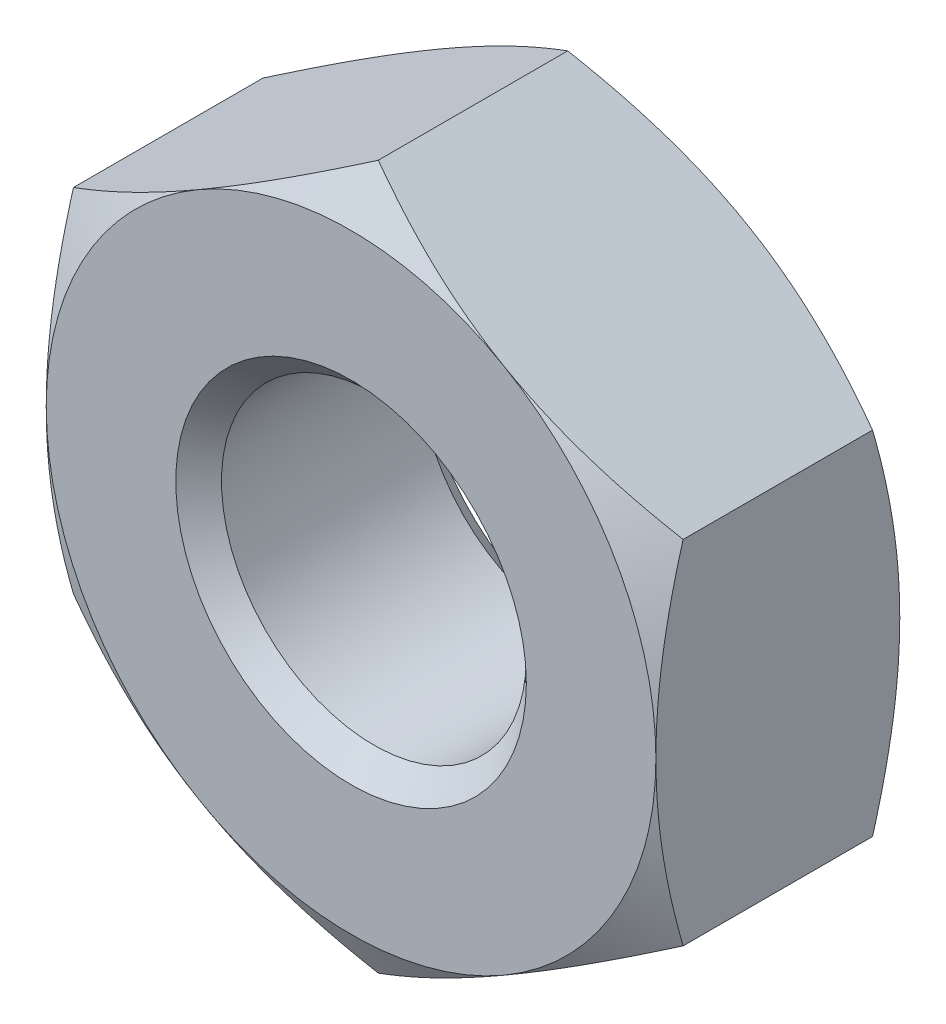
ISO-10303-21;
HEADER;
FILE_DESCRIPTION(('STEP AP214'),'2;1');
FILE_NAME('part.step','',(''),(''),'','','');
FILE_SCHEMA(('AUTOMOTIVE_DESIGN { 1 0 10303 214 1 1 1 1 }'));
ENDSEC;
DATA;
#1=APPLICATION_CONTEXT('core data for automotive mechanical design processes');
#2=APPLICATION_PROTOCOL_DEFINITION('international standard','automotive_design',2000,#1);
#3=PRODUCT_CONTEXT('',#1,'mechanical');
#4=PRODUCT('Part','Part','',(#3));
#5=PRODUCT_RELATED_PRODUCT_CATEGORY('part','',(#4));
#6=PRODUCT_DEFINITION_FORMATION('','',#4);
#7=PRODUCT_DEFINITION_CONTEXT('part definition',#1,'design');
#8=PRODUCT_DEFINITION('design','',#6,#7);
#9=PRODUCT_DEFINITION_SHAPE('','',#8);
#10=(LENGTH_UNIT() NAMED_UNIT(*) SI_UNIT(.MILLI.,.METRE.));
#11=(NAMED_UNIT(*) PLANE_ANGLE_UNIT() SI_UNIT($,.RADIAN.));
#12=(NAMED_UNIT(*) SI_UNIT($,.STERADIAN.) SOLID_ANGLE_UNIT());
#13=UNCERTAINTY_MEASURE_WITH_UNIT(LENGTH_MEASURE(1.E-05),#10,'distance_accuracy_value','');
#14=(GEOMETRIC_REPRESENTATION_CONTEXT(3) GLOBAL_UNCERTAINTY_ASSIGNED_CONTEXT((#13)) GLOBAL_UNIT_ASSIGNED_CONTEXT((#10,
#11,#12)) REPRESENTATION_CONTEXT('',''));
#15=CARTESIAN_POINT('',(0.,0.,0.));
#16=DIRECTION('',(0.,0.,1.));
#17=DIRECTION('',(1.,0.,0.));
#18=AXIS2_PLACEMENT_3D('',#15,#16,#17);
#19=CARTESIAN_POINT('',(0.,0.,1.6));
#20=DIRECTION('',(0.,0.,-1.));
#21=DIRECTION('',(-1.,0.,0.));
#22=AXIS2_PLACEMENT_3D('',#19,#20,#21);
#23=CONICAL_SURFACE('',#22,2.,1.0471975511966);
#24=CARTESIAN_POINT('',(-0.000200000000001084,2.30951654681234,1.4213005333795));
#25=CARTESIAN_POINT('',(0.0876912629000588,2.25877250251758,1.45061046389932));
#26=CARTESIAN_POINT('',(0.17634119447359,2.20759044065996,1.47726714801953));
#27=CARTESIAN_POINT('',(0.355176246997801,2.10433997494456,1.52379750897928));
#28=CARTESIAN_POINT('',(0.445364546505035,2.05226973594631,1.54365472361722));
#29=CARTESIAN_POINT('',(0.624623385763305,1.94877459684592,1.57456653597674));
#30=CARTESIAN_POINT('',(0.713666338226303,1.89736562427197,1.58582684840147));
#31=CARTESIAN_POINT('',(0.892171397785042,1.79430568008402,1.59927133740536));
#32=CARTESIAN_POINT('',(0.981632855703957,1.74265508327244,1.60146664504653));
#33=CARTESIAN_POINT('',(1.1488083535488,1.64613626458981,1.59690901066935));
#34=CARTESIAN_POINT('',(1.22654737026578,1.60125362236173,1.59127512531298));
#35=CARTESIAN_POINT('',(1.38151891453613,1.51178075956051,1.57341610473917));
#36=CARTESIAN_POINT('',(1.4587509057412,1.46719084864821,1.56118486397656));
#37=CARTESIAN_POINT('',(1.6140421864822,1.37753338590959,1.53060656313239));
#38=CARTESIAN_POINT('',(1.69208181310738,1.33247718647009,1.51212983293428));
#39=CARTESIAN_POINT('',(1.84699686569213,1.24303693915876,1.47019448178714));
#40=CARTESIAN_POINT('',(1.92387427762312,1.1986517446858,1.44674571950768));
#41=CARTESIAN_POINT('',(2.0002,1.15458506832542,1.4213005333795));
#42=B_SPLINE_CURVE_WITH_KNOTS('',3,(#24,#25,#26,#27,#28,#29,#30,#31,#32,#33,#34,#35,#36,#37,#38,
#39,#40,#41),.UNSPECIFIED.,.F.,.F.,(4,2,2,2,2,2,2,2,4),(0.,0.31703182469561,0.634825876346563,
0.944753967652636,1.25430138000371,1.52387047293094,1.79368946861028,2.06949491027634,
2.34475850821472),.UNSPECIFIED.);
#43=CARTESIAN_POINT('',(0.,2.3094010767585,1.42136720504592));
#44=VERTEX_POINT('',#43);
#45=CARTESIAN_POINT('',(1.,1.73205080756888,1.6));
#46=VERTEX_POINT('',#45);
#47=EDGE_CURVE('E291',#44,#46,#42,.T.);
#48=ORIENTED_EDGE('',*,*,#47,.F.);
#49=CARTESIAN_POINT('',(-2.0002,1.15458506832541,1.4213005333795));
#50=CARTESIAN_POINT('',(-1.91230873709994,1.20532911262018,1.45061046389932));
#51=CARTESIAN_POINT('',(-1.82365880552641,1.2565111744778,1.47726714801953));
#52=CARTESIAN_POINT('',(-1.6448237530022,1.35976164019319,1.52379750897928));
#53=CARTESIAN_POINT('',(-1.55463545349496,1.41183187919145,1.54365472361722));
#54=CARTESIAN_POINT('',(-1.37537661423669,1.51532701829183,1.57456653597675));
#55=CARTESIAN_POINT('',(-1.2863336617737,1.56673599086578,1.58582684840147));
#56=CARTESIAN_POINT('',(-1.10782860221496,1.66979593505373,1.59927133740536));
#57=CARTESIAN_POINT('',(-1.01836714429604,1.72144653186531,1.60146664504653));
#58=CARTESIAN_POINT('',(-0.851191646451202,1.81796535054794,1.59690901066935));
#59=CARTESIAN_POINT('',(-0.773452629734216,1.86284799277603,1.59127512531298));
#60=CARTESIAN_POINT('',(-0.618481085463867,1.95232085557725,1.57341610473917));
#61=CARTESIAN_POINT('',(-0.541249094258802,1.99691076648954,1.56118486397656));
#62=CARTESIAN_POINT('',(-0.3859578135178,2.08656822922816,1.53060656313239));
#63=CARTESIAN_POINT('',(-0.307918186892622,2.13162442866767,1.51212983293428));
#64=CARTESIAN_POINT('',(-0.153003134307866,2.221064675979,1.47019448178714));
#65=CARTESIAN_POINT('',(-0.0761257223768809,2.26544987045196,1.44674571950768));
#66=CARTESIAN_POINT('',(0.000199999999998884,2.30951654681234,1.4213005333795));
#67=B_SPLINE_CURVE_WITH_KNOTS('',3,(#49,#50,#51,#52,#53,#54,#55,#56,#57,#58,#59,#60,#61,#62,#63,
#64,#65,#66),.UNSPECIFIED.,.F.,.F.,(4,2,2,2,2,2,2,2,4),(0.,0.31703182469561,0.634825876346563,
0.944753967652636,1.25430138000371,1.52387047293094,1.79368946861028,2.06949491027634,
2.34475850821472),.UNSPECIFIED.);
#68=CARTESIAN_POINT('',(-0.999999999999998,1.73205080756887,1.6));
#69=VERTEX_POINT('',#68);
#70=EDGE_CURVE('E186',#69,#44,#67,.T.);
#71=ORIENTED_EDGE('',*,*,#70,.F.);
#72=CARTESIAN_POINT('',(0.,0.,1.6));
#73=DIRECTION('',(0.,0.,1.));
#74=DIRECTION('',(1.,0.,0.));
#75=AXIS2_PLACEMENT_3D('',#72,#73,#74);
#76=CIRCLE('',#75,2.);
#77=EDGE_CURVE('E294',#46,#69,#76,.T.);
#78=ORIENTED_EDGE('',*,*,#77,.F.);
#79=EDGE_LOOP('',(#48,#71,#78));
#80=FACE_BOUND('',#79,.T.);
#81=ADVANCED_FACE('F35',(#80),#23,.T.);
#82=CARTESIAN_POINT('',(2.,1.15470053837925,1.42136720504592));
#83=VERTEX_POINT('',#82);
#84=EDGE_CURVE('E229',#46,#83,#42,.T.);
#85=ORIENTED_EDGE('',*,*,#84,.F.);
#86=CARTESIAN_POINT('',(2.,0.,1.6));
#87=VERTEX_POINT('',#86);
#88=EDGE_CURVE('E151',#87,#46,#76,.T.);
#89=ORIENTED_EDGE('',*,*,#88,.F.);
#90=CARTESIAN_POINT('',(2.,-3.11808546430677,0.615973739345057));
#91=CARTESIAN_POINT('',(2.,-3.03059536742871,0.658480033195258));
#92=CARTESIAN_POINT('',(2.,-2.94290619080794,0.700583493586012));
#93=CARTESIAN_POINT('',(2.,-2.7670238765755,0.783758521065642));
#94=CARTESIAN_POINT('',(2.,-2.6788306636553,0.824829928730308));
#95=CARTESIAN_POINT('',(2.,-2.50138788505833,0.905917763099097));
#96=CARTESIAN_POINT('',(2.,-2.41213519219687,0.945927369986617));
#97=CARTESIAN_POINT('',(2.,-2.23292567246499,1.02433113469995));
#98=CARTESIAN_POINT('',(2.,-2.14296887861201,1.06272536774362));
#99=CARTESIAN_POINT('',(2.,-1.95923740452064,1.13870090452148));
#100=CARTESIAN_POINT('',(2.,-1.86543438996343,1.17621405734274));
#101=CARTESIAN_POINT('',(2.,-1.67673697705311,1.24844078497413));
#102=CARTESIAN_POINT('',(2.,-1.58184245844445,1.28315404786676));
#103=CARTESIAN_POINT('',(2.,-1.39098346001819,1.34888168779678));
#104=CARTESIAN_POINT('',(2.,-1.29502153646243,1.37990341386613));
#105=CARTESIAN_POINT('',(2.,-1.10172117700937,1.43726342150612));
#106=CARTESIAN_POINT('',(2.,-1.00438317984166,1.46360316102026));
#107=CARTESIAN_POINT('',(2.,-0.808821352727574,1.51020394859146));
#108=CARTESIAN_POINT('',(2.,-0.710605706499487,1.53049870815381));
#109=CARTESIAN_POINT('',(2.,-0.512936626317319,1.56387608627684));
#110=CARTESIAN_POINT('',(2.,-0.413483314981086,1.57695941356199));
#111=CARTESIAN_POINT('',(2.,-0.215137505223047,1.5946961720179));
#112=CARTESIAN_POINT('',(2.,-0.116255096681291,1.59945923727412));
#113=CARTESIAN_POINT('',(2.,0.0815498037441203,1.60045384016543));
#114=CARTESIAN_POINT('',(2.,0.180472296165458,1.59668525929592));
#115=CARTESIAN_POINT('',(2.,0.416823631950218,1.57781485282918));
#116=CARTESIAN_POINT('',(2.,0.553942776810828,1.55880651587805));
#117=CARTESIAN_POINT('',(2.,0.825719290942189,1.50768187545579));
#118=CARTESIAN_POINT('',(2.,0.960374168157715,1.47555299443112));
#119=CARTESIAN_POINT('',(2.,1.22992965051673,1.40088882265339));
#120=CARTESIAN_POINT('',(2.,1.36476871232831,1.35813735204327));
#121=CARTESIAN_POINT('',(2.,1.63194234229391,1.26565130319806));
#122=CARTESIAN_POINT('',(2.,1.76427755359467,1.21591854660777));
#123=CARTESIAN_POINT('',(2.,1.98708624722452,1.12741930497952));
#124=CARTESIAN_POINT('',(2.,2.07806632219504,1.08990992322051));
#125=CARTESIAN_POINT('',(2.,2.25923361475863,1.01301835687255));
#126=CARTESIAN_POINT('',(2.,2.34942080587598,0.973636110024807));
#127=CARTESIAN_POINT('',(2.,2.61903799534552,0.8532725002582));
#128=CARTESIAN_POINT('',(2.,2.79748330282355,0.770090706665526));
#129=CARTESIAN_POINT('',(2.,3.1527348412462,0.599862093013971));
#130=CARTESIAN_POINT('',(2.,3.32953911603553,0.512811236185322));
#131=CARTESIAN_POINT('',(2.,3.68185790999972,0.336128910035349));
#132=CARTESIAN_POINT('',(2.,3.85737238305287,0.246497348989458));
#133=CARTESIAN_POINT('',(2.,4.19244692776626,0.073184968081291));
#134=CARTESIAN_POINT('',(2.,4.35208430579579,-0.0103469184155998));
#135=CARTESIAN_POINT('',(2.,4.67076469793057,-0.178550117539633));
#136=CARTESIAN_POINT('',(2.,4.82980768937238,-0.263221473058663));
#137=CARTESIAN_POINT('',(2.,5.14701693726293,-0.433208838482621));
#138=CARTESIAN_POINT('',(2.,5.30518439786986,-0.518522604687186));
#139=CARTESIAN_POINT('',(2.,5.6211401049426,-0.689828103486113));
#140=CARTESIAN_POINT('',(1.99999999999999,5.77892837276597,-0.775819796671092));
#141=CARTESIAN_POINT('',(1.99999999999999,5.93657761627067,-0.862063844049043));
#142=B_SPLINE_CURVE_WITH_KNOTS('',3,(#90,#91,#92,#93,#94,#95,#96,#97,#98,#99,#100,#101,#102,
#103,#104,#105,#106,#107,#108,#109,#110,#111,#112,#113,#114,#115,#116,#117,#118,#119,#120,#121,
#122,#123,#124,#125,#126,#127,#128,#129,#130,#131,#132,#133,#134,#135,#136,#137,#138,#139,#140,
#141),.UNSPECIFIED.,.F.,.F.,(4,2,2,2,2,2,2,2,2,2,2,2,2,2,2,2,2,2,2,2,2,2,2,2,2,4),(0.,
0.291811160501009,0.583667124219355,0.877084537282781,1.17048827257679,1.47353156121617,
1.7766085634374,2.07907173812476,2.38144056190181,2.68209013511248,2.98271015584107,
3.27933822463719,3.57597041362389,3.99040738737124,4.40524258281003,4.82933296227693,
5.25331288774306,5.54851855793487,5.84373404838214,6.43429554435262,7.02548836872249,
7.61670223153918,8.15721053607346,8.69773924364617,9.23686495853664,9.77595956063144),.UNSPECIFIED.);
#143=EDGE_CURVE('E227',#83,#87,#142,.F.);
#144=ORIENTED_EDGE('',*,*,#143,.F.);
#145=EDGE_LOOP('',(#85,#89,#144));
#146=FACE_BOUND('',#145,.T.);
#147=ADVANCED_FACE('F282',(#146),#23,.T.);
#148=CARTESIAN_POINT('',(2.,-1.15470053837925,1.42136720504592));
#149=VERTEX_POINT('',#148);
#150=EDGE_CURVE('E222',#87,#149,#142,.F.);
#151=ORIENTED_EDGE('',*,*,#150,.F.);
#152=CARTESIAN_POINT('',(1.,-1.73205080756888,1.6));
#153=VERTEX_POINT('',#152);
#154=EDGE_CURVE('E297',#153,#87,#76,.T.);
#155=ORIENTED_EDGE('',*,*,#154,.F.);
#156=CARTESIAN_POINT('',(2.0002,-1.15458506832541,1.4213005333795));
#157=CARTESIAN_POINT('',(1.91230873709994,-1.20532911262018,1.45061046389932));
#158=CARTESIAN_POINT('',(1.82365880552641,-1.2565111744778,1.47726714801953));
#159=CARTESIAN_POINT('',(1.6448237530022,-1.35976164019319,1.52379750897928));
#160=CARTESIAN_POINT('',(1.55463545349496,-1.41183187919145,1.54365472361722));
#161=CARTESIAN_POINT('',(1.37537661423669,-1.51532701829183,1.57456653597675));
#162=CARTESIAN_POINT('',(1.2863336617737,-1.56673599086578,1.58582684840147));
#163=CARTESIAN_POINT('',(1.10782860221496,-1.66979593505373,1.59927133740536));
#164=CARTESIAN_POINT('',(1.01836714429604,-1.72144653186531,1.60146664504653));
#165=CARTESIAN_POINT('',(0.851191646451201,-1.81796535054794,1.59690901066935));
#166=CARTESIAN_POINT('',(0.773452629734216,-1.86284799277603,1.59127512531298));
#167=CARTESIAN_POINT('',(0.618481085463866,-1.95232085557725,1.57341610473917));
#168=CARTESIAN_POINT('',(0.541249094258801,-1.99691076648954,1.56118486397656));
#169=CARTESIAN_POINT('',(0.385957813517799,-2.08656822922816,1.53060656313239));
#170=CARTESIAN_POINT('',(0.30791818689262,-2.13162442866767,1.51212983293428));
#171=CARTESIAN_POINT('',(0.153003134307865,-2.221064675979,1.47019448178714));
#172=CARTESIAN_POINT('',(0.0761257223768801,-2.26544987045196,1.44674571950768));
#173=CARTESIAN_POINT('',(-0.00019999999999975,-2.30951654681234,1.4213005333795));
#174=B_SPLINE_CURVE_WITH_KNOTS('',3,(#156,#157,#158,#159,#160,#161,#162,#163,#164,#165,#166,
#167,#168,#169,#170,#171,#172,#173),.UNSPECIFIED.,.F.,.F.,(4,2,2,2,2,2,2,2,4),(0.,
0.31703182469561,0.634825876346563,0.944753967652635,1.25430138000371,1.52387047293094,
1.79368946861028,2.06949491027634,2.34475850821472),.UNSPECIFIED.);
#175=EDGE_CURVE('E228',#149,#153,#174,.T.);
#176=ORIENTED_EDGE('',*,*,#175,.F.);
#177=EDGE_LOOP('',(#151,#155,#176));
#178=FACE_BOUND('',#177,.T.);
#179=ADVANCED_FACE('F287',(#178),#23,.T.);
#180=CARTESIAN_POINT('',(0.,-2.3094010767585,1.42136720504592));
#181=VERTEX_POINT('',#180);
#182=EDGE_CURVE('E216',#153,#181,#174,.T.);
#183=ORIENTED_EDGE('',*,*,#182,.F.);
#184=CARTESIAN_POINT('',(-1.,-1.73205080756888,1.6));
#185=VERTEX_POINT('',#184);
#186=EDGE_CURVE('E299',#185,#153,#76,.T.);
#187=ORIENTED_EDGE('',*,*,#186,.F.);
#188=CARTESIAN_POINT('',(0.000200000000000217,-2.30951654681234,1.4213005333795));
#189=CARTESIAN_POINT('',(-0.0876912629000599,-2.25877250251758,1.45061046389932));
#190=CARTESIAN_POINT('',(-0.176341194473591,-2.20759044065995,1.47726714801953));
#191=CARTESIAN_POINT('',(-0.355176246997802,-2.10433997494456,1.52379750897928));
#192=CARTESIAN_POINT('',(-0.445364546505036,-2.0522697359463,1.54365472361722));
#193=CARTESIAN_POINT('',(-0.624623385763305,-1.94877459684592,1.57456653597675));
#194=CARTESIAN_POINT('',(-0.713666338226304,-1.89736562427197,1.58582684840147));
#195=CARTESIAN_POINT('',(-0.892171397785043,-1.79430568008402,1.59927133740536));
#196=CARTESIAN_POINT('',(-0.981632855703958,-1.74265508327244,1.60146664504653));
#197=CARTESIAN_POINT('',(-1.1488083535488,-1.64613626458981,1.59690901066935));
#198=CARTESIAN_POINT('',(-1.22654737026578,-1.60125362236173,1.59127512531298));
#199=CARTESIAN_POINT('',(-1.38151891453613,-1.51178075956051,1.57341610473917));
#200=CARTESIAN_POINT('',(-1.4587509057412,-1.46719084864821,1.56118486397656));
#201=CARTESIAN_POINT('',(-1.6140421864822,-1.37753338590959,1.53060656313239));
#202=CARTESIAN_POINT('',(-1.69208181310738,-1.33247718647009,1.51212983293428));
#203=CARTESIAN_POINT('',(-1.84699686569213,-1.24303693915875,1.47019448178714));
#204=CARTESIAN_POINT('',(-1.92387427762312,-1.1986517446858,1.44674571950768));
#205=CARTESIAN_POINT('',(-2.0002,-1.15458506832541,1.4213005333795));
#206=B_SPLINE_CURVE_WITH_KNOTS('',3,(#188,#189,#190,#191,#192,#193,#194,#195,#196,#197,#198,
#199,#200,#201,#202,#203,#204,#205),.UNSPECIFIED.,.F.,.F.,(4,2,2,2,2,2,2,2,4),(0.,
0.31703182469561,0.634825876346563,0.944753967652635,1.25430138000371,1.52387047293094,
1.79368946861028,2.06949491027634,2.34475850821472),.UNSPECIFIED.);
#207=EDGE_CURVE('E323',#181,#185,#206,.T.);
#208=ORIENTED_EDGE('',*,*,#207,.F.);
#209=EDGE_LOOP('',(#183,#187,#208));
#210=FACE_BOUND('',#209,.T.);
#211=ADVANCED_FACE('F327',(#210),#23,.T.);
#212=CARTESIAN_POINT('',(-2.,-1.15470053837925,1.42136720504592));
#213=VERTEX_POINT('',#212);
#214=EDGE_CURVE('E211',#185,#213,#206,.T.);
#215=ORIENTED_EDGE('',*,*,#214,.F.);
#216=CARTESIAN_POINT('',(-2.,0.,1.6));
#217=VERTEX_POINT('',#216);
#218=EDGE_CURVE('E314',#217,#185,#76,.T.);
#219=ORIENTED_EDGE('',*,*,#218,.F.);
#220=CARTESIAN_POINT('',(-2.,-3.11808546430677,0.615973739345057));
#221=CARTESIAN_POINT('',(-2.,-3.03059536742872,0.658480033195257));
#222=CARTESIAN_POINT('',(-2.,-2.94290619080794,0.700583493586012));
#223=CARTESIAN_POINT('',(-2.,-2.76702387657551,0.783758521065642));
#224=CARTESIAN_POINT('',(-2.,-2.6788306636553,0.824829928730309));
#225=CARTESIAN_POINT('',(-2.,-2.50138788505833,0.905917763099098));
#226=CARTESIAN_POINT('',(-2.,-2.41213519219687,0.945927369986617));
#227=CARTESIAN_POINT('',(-2.,-2.23292567246499,1.02433113469995));
#228=CARTESIAN_POINT('',(-2.,-2.14296887861201,1.06272536774362));
#229=CARTESIAN_POINT('',(-2.,-1.95923740452064,1.13870090452148));
#230=CARTESIAN_POINT('',(-2.,-1.86543438996343,1.17621405734274));
#231=CARTESIAN_POINT('',(-2.,-1.67673697705311,1.24844078497413));
#232=CARTESIAN_POINT('',(-2.,-1.58184245844445,1.28315404786676));
#233=CARTESIAN_POINT('',(-2.,-1.39098346001819,1.34888168779678));
#234=CARTESIAN_POINT('',(-2.,-1.29502153646243,1.37990341386613));
#235=CARTESIAN_POINT('',(-2.,-1.10172117700937,1.43726342150612));
#236=CARTESIAN_POINT('',(-2.,-1.00438317984166,1.46360316102026));
#237=CARTESIAN_POINT('',(-2.,-0.808821352727574,1.51020394859146));
#238=CARTESIAN_POINT('',(-2.,-0.710605706499488,1.53049870815381));
#239=CARTESIAN_POINT('',(-2.,-0.512936626317319,1.56387608627684));
#240=CARTESIAN_POINT('',(-2.,-0.413483314981086,1.57695941356199));
#241=CARTESIAN_POINT('',(-2.,-0.215137505223048,1.5946961720179));
#242=CARTESIAN_POINT('',(-2.,-0.116255096681291,1.59945923727412));
#243=CARTESIAN_POINT('',(-2.,0.0815498037441203,1.60045384016543));
#244=CARTESIAN_POINT('',(-2.,0.180472296165458,1.59668525929592));
#245=CARTESIAN_POINT('',(-2.,0.416823631950218,1.57781485282918));
#246=CARTESIAN_POINT('',(-2.,0.553942776810828,1.55880651587804));
#247=CARTESIAN_POINT('',(-2.,0.825719290942189,1.50768187545579));
#248=CARTESIAN_POINT('',(-2.,0.960374168157716,1.47555299443112));
#249=CARTESIAN_POINT('',(-2.,1.22992965051673,1.40088882265338));
#250=CARTESIAN_POINT('',(-2.,1.36476871232831,1.35813735204327));
#251=CARTESIAN_POINT('',(-2.,1.63194234229391,1.26565130319806));
#252=CARTESIAN_POINT('',(-2.,1.76427755359467,1.21591854660776));
#253=CARTESIAN_POINT('',(-2.,1.98708624722452,1.12741930497952));
#254=CARTESIAN_POINT('',(-2.,2.07806632219504,1.08990992322051));
#255=CARTESIAN_POINT('',(-2.,2.25923361475863,1.01301835687255));
#256=CARTESIAN_POINT('',(-2.,2.34942080587598,0.973636110024806));
#257=CARTESIAN_POINT('',(-2.,2.61903799534552,0.853272500258199));
#258=CARTESIAN_POINT('',(-2.,2.79748330282355,0.770090706665525));
#259=CARTESIAN_POINT('',(-2.,3.1527348412462,0.59986209301397));
#260=CARTESIAN_POINT('',(-2.,3.32953911603553,0.512811236185321));
#261=CARTESIAN_POINT('',(-2.,3.68185790999972,0.336128910035348));
#262=CARTESIAN_POINT('',(-2.,3.85737238305287,0.246497348989457));
#263=CARTESIAN_POINT('',(-2.,4.19244692776626,0.07318496808129));
#264=CARTESIAN_POINT('',(-2.,4.35208430579579,-0.0103469184156006));
#265=CARTESIAN_POINT('',(-2.,4.67076469793057,-0.178550117539634));
#266=CARTESIAN_POINT('',(-2.,4.82980768937238,-0.263221473058663));
#267=CARTESIAN_POINT('',(-2.,5.14701693726293,-0.433208838482621));
#268=CARTESIAN_POINT('',(-2.,5.30518439786986,-0.518522604687187));
#269=CARTESIAN_POINT('',(-2.,5.6211401049426,-0.689828103486114));
#270=CARTESIAN_POINT('',(-2.,5.77892837276597,-0.775819796671093));
#271=CARTESIAN_POINT('',(-2.,5.93657761627067,-0.862063844049043));
#272=B_SPLINE_CURVE_WITH_KNOTS('',3,(#220,#221,#222,#223,#224,#225,#226,#227,#228,#229,#230,
#231,#232,#233,#234,#235,#236,#237,#238,#239,#240,#241,#242,#243,#244,#245,#246,#247,#248,#249,
#250,#251,#252,#253,#254,#255,#256,#257,#258,#259,#260,#261,#262,#263,#264,#265,#266,#267,#268,
#269,#270,#271),.UNSPECIFIED.,.F.,.F.,(4,2,2,2,2,2,2,2,2,2,2,2,2,2,2,2,2,2,2,2,2,2,2,2,2,4),(0.,
0.291811160501009,0.583667124219356,0.877084537282782,1.17048827257679,1.47353156121617,
1.7766085634374,2.07907173812476,2.38144056190181,2.68209013511248,2.98271015584107,
3.27933822463719,3.57597041362389,3.99040738737124,4.40524258281003,4.82933296227693,
5.25331288774306,5.54851855793487,5.84373404838214,6.43429554435262,7.02548836872249,
7.61670223153918,8.15721053607346,8.69773924364616,9.23686495853663,9.77595956063144),.UNSPECIFIED.);
#273=EDGE_CURVE('E319',#213,#217,#272,.T.);
#274=ORIENTED_EDGE('',*,*,#273,.F.);
#275=EDGE_LOOP('',(#215,#219,#274));
#276=FACE_BOUND('',#275,.T.);
#277=ADVANCED_FACE('F203',(#276),#23,.T.);
#278=CARTESIAN_POINT('',(0.,0.,0.577350269189626));
#279=DIRECTION('',(0.,0.,1.));
#280=DIRECTION('',(1.,0.,0.));
#281=AXIS2_PLACEMENT_3D('',#278,#279,#280);
#282=CONICAL_SURFACE('',#281,3.,1.0471975511966);
#283=CARTESIAN_POINT('',(-0.000199999999999783,-2.30951654681234,0.1786994666205));
#284=CARTESIAN_POINT('',(0.0876912629000602,-2.25877250251757,0.149389536100682));
#285=CARTESIAN_POINT('',(0.176341194473591,-2.20759044065995,0.12273285198047));
#286=CARTESIAN_POINT('',(0.355176246997802,-2.10433997494456,0.0762024910207238));
#287=CARTESIAN_POINT('',(0.445364546505036,-2.0522697359463,0.0563452763827819));
#288=CARTESIAN_POINT('',(0.624623385763306,-1.94877459684592,0.0254334640232555));
#289=CARTESIAN_POINT('',(0.713666338226304,-1.89736562427197,0.0141731515985343));
#290=CARTESIAN_POINT('',(0.892171397785043,-1.79430568008402,0.000728662594645065));
#291=CARTESIAN_POINT('',(0.981632855703958,-1.74265508327244,-0.00146664504652891));
#292=CARTESIAN_POINT('',(1.1488083535488,-1.64613626458981,0.00309098933065151));
#293=CARTESIAN_POINT('',(1.22654737026578,-1.60125362236173,0.00872487468701735));
#294=CARTESIAN_POINT('',(1.38151891453613,-1.51178075956051,0.0265838952608313));
#295=CARTESIAN_POINT('',(1.4587509057412,-1.46719084864821,0.0388151360234423));
#296=CARTESIAN_POINT('',(1.6140421864822,-1.37753338590959,0.0693934368676127));
#297=CARTESIAN_POINT('',(1.69208181310738,-1.33247718647009,0.0878701670657187));
#298=CARTESIAN_POINT('',(1.84699686569213,-1.24303693915875,0.129805518212858));
#299=CARTESIAN_POINT('',(1.92387427762312,-1.1986517446858,0.153254280492316));
#300=CARTESIAN_POINT('',(2.0002,-1.15458506832541,0.1786994666205));
#301=B_SPLINE_CURVE_WITH_KNOTS('',3,(#283,#284,#285,#286,#287,#288,#289,#290,#291,#292,#293,
#294,#295,#296,#297,#298,#299,#300),.UNSPECIFIED.,.F.,.F.,(4,2,2,2,2,2,2,2,4),(0.,
0.31703182469561,0.634825876346563,0.944753967652635,1.25430138000371,1.52387047293094,
1.79368946861028,2.06949491027634,2.34475850821472),.UNSPECIFIED.);
#302=CARTESIAN_POINT('',(0.,-2.3094010767585,0.178632794954083));
#303=VERTEX_POINT('',#302);
#304=CARTESIAN_POINT('',(1.,-1.73205080756888,0.));
#305=VERTEX_POINT('',#304);
#306=EDGE_CURVE('E259',#303,#305,#301,.T.);
#307=ORIENTED_EDGE('',*,*,#306,.F.);
#308=CARTESIAN_POINT('',(-2.0002,-1.15458506832541,0.1786994666205));
#309=CARTESIAN_POINT('',(-1.91230873709994,-1.20532911262018,0.149389536100681));
#310=CARTESIAN_POINT('',(-1.82365880552641,-1.2565111744778,0.122732851980469));
#311=CARTESIAN_POINT('',(-1.6448237530022,-1.35976164019319,0.0762024910207238));
#312=CARTESIAN_POINT('',(-1.55463545349496,-1.41183187919145,0.056345276382782));
#313=CARTESIAN_POINT('',(-1.37537661423669,-1.51532701829183,0.0254334640232555));
#314=CARTESIAN_POINT('',(-1.2863336617737,-1.56673599086578,0.0141731515985342));
#315=CARTESIAN_POINT('',(-1.10782860221496,-1.66979593505373,0.000728662594645026));
#316=CARTESIAN_POINT('',(-1.01836714429604,-1.72144653186531,-0.00146664504652869));
#317=CARTESIAN_POINT('',(-0.851191646451201,-1.81796535054794,0.0030909893306519));
#318=CARTESIAN_POINT('',(-0.773452629734216,-1.86284799277603,0.00872487468701769));
#319=CARTESIAN_POINT('',(-0.618481085463866,-1.95232085557725,0.0265838952608314));
#320=CARTESIAN_POINT('',(-0.541249094258801,-1.99691076648954,0.0388151360234423));
#321=CARTESIAN_POINT('',(-0.385957813517799,-2.08656822922816,0.0693934368676126));
#322=CARTESIAN_POINT('',(-0.30791818689262,-2.13162442866767,0.0878701670657187));
#323=CARTESIAN_POINT('',(-0.153003134307865,-2.221064675979,0.129805518212859));
#324=CARTESIAN_POINT('',(-0.0761257223768801,-2.26544987045196,0.153254280492316));
#325=CARTESIAN_POINT('',(0.000200000000000089,-2.30951654681234,0.1786994666205));
#326=B_SPLINE_CURVE_WITH_KNOTS('',3,(#308,#309,#310,#311,#312,#313,#314,#315,#316,#317,#318,
#319,#320,#321,#322,#323,#324,#325),.UNSPECIFIED.,.F.,.F.,(4,2,2,2,2,2,2,2,4),(0.,
0.31703182469561,0.634825876346563,0.944753967652635,1.25430138000371,1.52387047293094,
1.79368946861028,2.06949491027634,2.34475850821472),.UNSPECIFIED.);
#327=CARTESIAN_POINT('',(-1.,-1.73205080756888,0.));
#328=VERTEX_POINT('',#327);
#329=EDGE_CURVE('E260',#328,#303,#326,.T.);
#330=ORIENTED_EDGE('',*,*,#329,.F.);
#331=CARTESIAN_POINT('',(0.,0.,0.));
#332=DIRECTION('',(0.,0.,1.));
#333=DIRECTION('',(1.,0.,0.));
#334=AXIS2_PLACEMENT_3D('',#331,#332,#333);
#335=CIRCLE('',#334,1.99999999999999);
#336=EDGE_CURVE('E162',#305,#328,#335,.F.);
#337=ORIENTED_EDGE('',*,*,#336,.F.);
#338=EDGE_LOOP('',(#307,#330,#337));
#339=FACE_BOUND('',#338,.T.);
#340=ADVANCED_FACE('F358',(#339),#282,.T.);
#341=CARTESIAN_POINT('',(2.,-1.15470053837925,0.178632794954083));
#342=VERTEX_POINT('',#341);
#343=EDGE_CURVE('E254',#305,#342,#301,.T.);
#344=ORIENTED_EDGE('',*,*,#343,.F.);
#345=CARTESIAN_POINT('',(2.,0.,0.));
#346=VERTEX_POINT('',#345);
#347=EDGE_CURVE('E153',#346,#305,#335,.F.);
#348=ORIENTED_EDGE('',*,*,#347,.F.);
#349=CARTESIAN_POINT('',(2.,-3.11808546430677,0.984026260654943));
#350=CARTESIAN_POINT('',(2.,-3.03059536742871,0.941519966804742));
#351=CARTESIAN_POINT('',(2.,-2.94290619080794,0.899416506413988));
#352=CARTESIAN_POINT('',(2.,-2.7670238765755,0.816241478934357));
#353=CARTESIAN_POINT('',(2.,-2.6788306636553,0.775170071269691));
#354=CARTESIAN_POINT('',(2.,-2.50138788505833,0.694082236900902));
#355=CARTESIAN_POINT('',(2.,-2.41213519219687,0.654072630013383));
#356=CARTESIAN_POINT('',(2.,-2.23292567246499,0.575668865300051));
#357=CARTESIAN_POINT('',(2.,-2.14296887861201,0.537274632256379));
#358=CARTESIAN_POINT('',(2.,-1.95923740452063,0.461299095478518));
#359=CARTESIAN_POINT('',(2.,-1.86543438996343,0.423785942657257));
#360=CARTESIAN_POINT('',(2.,-1.67673697705311,0.351559215025875));
#361=CARTESIAN_POINT('',(2.,-1.58184245844445,0.316845952133238));
#362=CARTESIAN_POINT('',(2.,-1.39098346001819,0.251118312203222));
#363=CARTESIAN_POINT('',(2.,-1.29502153646243,0.220096586133872));
#364=CARTESIAN_POINT('',(2.,-1.10172117700937,0.162736578493883));
#365=CARTESIAN_POINT('',(2.,-1.00438317984166,0.136396838979739));
#366=CARTESIAN_POINT('',(2.,-0.808821352727574,0.0897960514085434));
#367=CARTESIAN_POINT('',(2.,-0.710605706499487,0.0695012918461867));
#368=CARTESIAN_POINT('',(2.,-0.512936626317319,0.0361239137231615));
#369=CARTESIAN_POINT('',(2.,-0.413483314981086,0.023040586438008));
#370=CARTESIAN_POINT('',(2.,-0.215137505223047,0.00530382798210204));
#371=CARTESIAN_POINT('',(2.,-0.11625509668129,0.000540762725879629));
#372=CARTESIAN_POINT('',(2.,0.0815498037441207,-0.000453840165432031));
#373=CARTESIAN_POINT('',(2.,0.180472296165458,0.00331474070408474));
#374=CARTESIAN_POINT('',(2.,0.416823631950219,0.0221851471708206));
#375=CARTESIAN_POINT('',(2.,0.553942776810829,0.0411934841219549));
#376=CARTESIAN_POINT('',(2.,0.82571929094219,0.0923181245442068));
#377=CARTESIAN_POINT('',(2.,0.960374168157717,0.124447005568881));
#378=CARTESIAN_POINT('',(2.,1.22992965051673,0.199111177346616));
#379=CARTESIAN_POINT('',(2.,1.36476871232831,0.241862647956728));
#380=CARTESIAN_POINT('',(2.,1.63194234229392,0.334348696801937));
#381=CARTESIAN_POINT('',(2.,1.76427755359467,0.384081453392235));
#382=CARTESIAN_POINT('',(2.,1.98708624722452,0.472580695020477));
#383=CARTESIAN_POINT('',(2.,2.07806632219505,0.510090076779488));
#384=CARTESIAN_POINT('',(2.,2.25923361475864,0.586981643127449));
#385=CARTESIAN_POINT('',(2.,2.34942080587598,0.626363889975193));
#386=CARTESIAN_POINT('',(2.,2.61903799534552,0.7467274997418));
#387=CARTESIAN_POINT('',(2.,2.79748330282355,0.829909293334474));
#388=CARTESIAN_POINT('',(2.,3.1527348412462,1.00013790698603));
#389=CARTESIAN_POINT('',(2.,3.32953911603553,1.08718876381468));
#390=CARTESIAN_POINT('',(2.,3.68185790999973,1.26387108996465));
#391=CARTESIAN_POINT('',(2.,3.85737238305288,1.35350265101054));
#392=CARTESIAN_POINT('',(2.,4.19244692776626,1.52681503191871));
#393=CARTESIAN_POINT('',(2.,4.35208430579579,1.6103469184156));
#394=CARTESIAN_POINT('',(2.,4.67076469793057,1.77855011753963));
#395=CARTESIAN_POINT('',(2.,4.82980768937238,1.86322147305866));
#396=CARTESIAN_POINT('',(2.,5.14701693726293,2.03320883848262));
#397=CARTESIAN_POINT('',(2.,5.30518439786986,2.11852260468719));
#398=CARTESIAN_POINT('',(2.,5.6211401049426,2.28982810348611));
#399=CARTESIAN_POINT('',(1.99999999999999,5.77892837276597,2.37581979667109));
#400=CARTESIAN_POINT('',(1.99999999999999,5.93657761627067,2.46206384404904));
#401=B_SPLINE_CURVE_WITH_KNOTS('',3,(#349,#350,#351,#352,#353,#354,#355,#356,#357,#358,#359,
#360,#361,#362,#363,#364,#365,#366,#367,#368,#369,#370,#371,#372,#373,#374,#375,#376,#377,#378,
#379,#380,#381,#382,#383,#384,#385,#386,#387,#388,#389,#390,#391,#392,#393,#394,#395,#396,#397,
#398,#399,#400),.UNSPECIFIED.,.F.,.F.,(4,2,2,2,2,2,2,2,2,2,2,2,2,2,2,2,2,2,2,2,2,2,2,2,2,4),(0.,
0.291811160501009,0.583667124219356,0.877084537282782,1.17048827257679,1.47353156121617,
1.7766085634374,2.07907173812476,2.38144056190181,2.68209013511248,2.98271015584107,
3.27933822463719,3.57597041362389,3.99040738737124,4.40524258281003,4.82933296227693,
5.25331288774306,5.54851855793487,5.84373404838214,6.43429554435262,7.02548836872249,
7.61670223153918,8.15721053607346,8.69773924364617,9.23686495853664,9.77595956063144),.UNSPECIFIED.);
#402=EDGE_CURVE('E249',#342,#346,#401,.T.);
#403=ORIENTED_EDGE('',*,*,#402,.F.);
#404=EDGE_LOOP('',(#344,#348,#403));
#405=FACE_BOUND('',#404,.T.);
#406=ADVANCED_FACE('F353',(#405),#282,.T.);
#407=CARTESIAN_POINT('',(2.,1.15470053837925,0.178632794954083));
#408=VERTEX_POINT('',#407);
#409=EDGE_CURVE('E147',#346,#408,#401,.T.);
#410=ORIENTED_EDGE('',*,*,#409,.F.);
#411=CARTESIAN_POINT('',(1.,1.73205080756888,0.));
#412=VERTEX_POINT('',#411);
#413=EDGE_CURVE('E145',#412,#346,#335,.F.);
#414=ORIENTED_EDGE('',*,*,#413,.F.);
#415=CARTESIAN_POINT('',(2.0002,1.15458506832542,0.1786994666205));
#416=CARTESIAN_POINT('',(1.91230873709994,1.20532911262018,0.149389536100681));
#417=CARTESIAN_POINT('',(1.82365880552641,1.2565111744778,0.122732851980469));
#418=CARTESIAN_POINT('',(1.6448237530022,1.3597616401932,0.0762024910207237));
#419=CARTESIAN_POINT('',(1.55463545349496,1.41183187919145,0.056345276382782));
#420=CARTESIAN_POINT('',(1.37537661423669,1.51532701829183,0.0254334640232556));
#421=CARTESIAN_POINT('',(1.28633366177369,1.56673599086578,0.0141731515985342));
#422=CARTESIAN_POINT('',(1.10782860221496,1.66979593505373,0.000728662594644972));
#423=CARTESIAN_POINT('',(1.01836714429604,1.72144653186531,-0.00146664504652859));
#424=CARTESIAN_POINT('',(0.8511916464512,1.81796535054794,0.00309098933065208));
#425=CARTESIAN_POINT('',(0.773452629734215,1.86284799277603,0.00872487468701783));
#426=CARTESIAN_POINT('',(0.618481085463865,1.95232085557725,0.0265838952608316));
#427=CARTESIAN_POINT('',(0.5412490942588,1.99691076648954,0.0388151360234427));
#428=CARTESIAN_POINT('',(0.385957813517798,2.08656822922816,0.0693934368676131));
#429=CARTESIAN_POINT('',(0.307918186892619,2.13162442866767,0.0878701670657191));
#430=CARTESIAN_POINT('',(0.153003134307864,2.221064675979,0.129805518212859));
#431=CARTESIAN_POINT('',(0.0761257223768789,2.26544987045196,0.153254280492316));
#432=CARTESIAN_POINT('',(-0.00020000000000102,2.30951654681234,0.178699466620501));
#433=B_SPLINE_CURVE_WITH_KNOTS('',3,(#415,#416,#417,#418,#419,#420,#421,#422,#423,#424,#425,
#426,#427,#428,#429,#430,#431,#432),.UNSPECIFIED.,.F.,.F.,(4,2,2,2,2,2,2,2,4),(0.,
0.31703182469561,0.634825876346563,0.944753967652635,1.25430138000371,1.52387047293094,
1.79368946861028,2.06949491027634,2.34475850821472),.UNSPECIFIED.);
#434=EDGE_CURVE('E125',#408,#412,#433,.T.);
#435=ORIENTED_EDGE('',*,*,#434,.F.);
#436=EDGE_LOOP('',(#410,#414,#435));
#437=FACE_BOUND('',#436,.T.);
#438=ADVANCED_FACE('F146',(#437),#282,.T.);
#439=CARTESIAN_POINT('',(-2.,-1.15470053837925,0.178632794954083));
#440=VERTEX_POINT('',#439);
#441=EDGE_CURVE('E250',#440,#328,#326,.T.);
#442=ORIENTED_EDGE('',*,*,#441,.F.);
#443=CARTESIAN_POINT('',(-2.,-3.11808546430677,0.984026260654943));
#444=CARTESIAN_POINT('',(-2.,-3.03059536742872,0.941519966804742));
#445=CARTESIAN_POINT('',(-2.,-2.94290619080794,0.899416506413988));
#446=CARTESIAN_POINT('',(-2.,-2.76702387657551,0.816241478934357));
#447=CARTESIAN_POINT('',(-2.,-2.6788306636553,0.775170071269691));
#448=CARTESIAN_POINT('',(-2.,-2.50138788505833,0.694082236900902));
#449=CARTESIAN_POINT('',(-2.,-2.41213519219687,0.654072630013383));
#450=CARTESIAN_POINT('',(-2.,-2.23292567246499,0.575668865300051));
#451=CARTESIAN_POINT('',(-2.,-2.14296887861201,0.537274632256379));
#452=CARTESIAN_POINT('',(-2.,-1.95923740452064,0.461299095478518));
#453=CARTESIAN_POINT('',(-2.,-1.86543438996343,0.423785942657257));
#454=CARTESIAN_POINT('',(-2.,-1.67673697705311,0.351559215025875));
#455=CARTESIAN_POINT('',(-2.,-1.58184245844445,0.316845952133238));
#456=CARTESIAN_POINT('',(-2.,-1.39098346001819,0.251118312203221));
#457=CARTESIAN_POINT('',(-2.,-1.29502153646243,0.220096586133872));
#458=CARTESIAN_POINT('',(-2.,-1.10172117700937,0.162736578493882));
#459=CARTESIAN_POINT('',(-2.,-1.00438317984166,0.136396838979739));
#460=CARTESIAN_POINT('',(-2.,-0.808821352727574,0.0897960514085435));
#461=CARTESIAN_POINT('',(-2.,-0.710605706499487,0.0695012918461869));
#462=CARTESIAN_POINT('',(-2.,-0.512936626317319,0.0361239137231618));
#463=CARTESIAN_POINT('',(-2.,-0.413483314981086,0.0230405864380084));
#464=CARTESIAN_POINT('',(-2.,-0.215137505223047,0.00530382798210222));
#465=CARTESIAN_POINT('',(-2.,-0.11625509668129,0.000540762725879718));
#466=CARTESIAN_POINT('',(-2.,0.0815498037441206,-0.000453840165431788));
#467=CARTESIAN_POINT('',(-2.,0.180472296165458,0.0033147407040852));
#468=CARTESIAN_POINT('',(-2.,0.416823631950219,0.0221851471708213));
#469=CARTESIAN_POINT('',(-2.,0.553942776810829,0.0411934841219557));
#470=CARTESIAN_POINT('',(-2.,0.82571929094219,0.0923181245442077));
#471=CARTESIAN_POINT('',(-2.,0.960374168157717,0.124447005568881));
#472=CARTESIAN_POINT('',(-2.,1.22992965051673,0.199111177346617));
#473=CARTESIAN_POINT('',(-2.,1.36476871232831,0.241862647956729));
#474=CARTESIAN_POINT('',(-2.,1.63194234229392,0.334348696801939));
#475=CARTESIAN_POINT('',(-2.,1.76427755359467,0.384081453392236));
#476=CARTESIAN_POINT('',(-2.,1.98708624722453,0.472580695020478));
#477=CARTESIAN_POINT('',(-2.,2.07806632219505,0.510090076779489));
#478=CARTESIAN_POINT('',(-2.,2.25923361475864,0.586981643127451));
#479=CARTESIAN_POINT('',(-2.,2.34942080587599,0.626363889975195));
#480=CARTESIAN_POINT('',(-2.,2.61903799534552,0.746727499741803));
#481=CARTESIAN_POINT('',(-2.,2.79748330282356,0.829909293334476));
#482=CARTESIAN_POINT('',(-2.,3.1527348412462,1.00013790698603));
#483=CARTESIAN_POINT('',(-2.,3.32953911603553,1.08718876381468));
#484=CARTESIAN_POINT('',(-2.,3.68185790999973,1.26387108996465));
#485=CARTESIAN_POINT('',(-2.,3.85737238305288,1.35350265101054));
#486=CARTESIAN_POINT('',(-2.,4.19244692776626,1.52681503191871));
#487=CARTESIAN_POINT('',(-2.,4.35208430579579,1.6103469184156));
#488=CARTESIAN_POINT('',(-2.,4.67076469793057,1.77855011753963));
#489=CARTESIAN_POINT('',(-2.,4.82980768937239,1.86322147305866));
#490=CARTESIAN_POINT('',(-2.,5.14701693726293,2.03320883848262));
#491=CARTESIAN_POINT('',(-2.,5.30518439786987,2.11852260468719));
#492=CARTESIAN_POINT('',(-2.,5.6211401049426,2.28982810348611));
#493=CARTESIAN_POINT('',(-2.,5.77892837276598,2.37581979667109));
#494=CARTESIAN_POINT('',(-2.,5.93657761627067,2.46206384404904));
#495=B_SPLINE_CURVE_WITH_KNOTS('',3,(#443,#444,#445,#446,#447,#448,#449,#450,#451,#452,#453,
#454,#455,#456,#457,#458,#459,#460,#461,#462,#463,#464,#465,#466,#467,#468,#469,#470,#471,#472,
#473,#474,#475,#476,#477,#478,#479,#480,#481,#482,#483,#484,#485,#486,#487,#488,#489,#490,#491,
#492,#493,#494),.UNSPECIFIED.,.F.,.F.,(4,2,2,2,2,2,2,2,2,2,2,2,2,2,2,2,2,2,2,2,2,2,2,2,2,4),(0.,
0.291811160501009,0.583667124219356,0.877084537282782,1.17048827257679,1.47353156121617,
1.7766085634374,2.07907173812476,2.38144056190182,2.68209013511248,2.98271015584107,
3.27933822463719,3.57597041362389,3.99040738737124,4.40524258281003,4.82933296227693,
5.25331288774307,5.54851855793487,5.84373404838214,6.43429554435262,7.02548836872249,
7.61670223153918,8.15721053607346,8.69773924364617,9.23686495853664,9.77595956063144),.UNSPECIFIED.);
#496=CARTESIAN_POINT('',(-2.,0.,0.));
#497=VERTEX_POINT('',#496);
#498=EDGE_CURVE('E135',#497,#440,#495,.F.);
#499=ORIENTED_EDGE('',*,*,#498,.F.);
#500=EDGE_CURVE('E158',#328,#497,#335,.F.);
#501=ORIENTED_EDGE('',*,*,#500,.F.);
#502=EDGE_LOOP('',(#442,#499,#501));
#503=FACE_BOUND('',#502,.T.);
#504=ADVANCED_FACE('F360',(#503),#282,.T.);
#505=CARTESIAN_POINT('',(0.,2.3094010767585,0.178632794954084));
#506=VERTEX_POINT('',#505);
#507=EDGE_CURVE('E129',#412,#506,#433,.T.);
#508=ORIENTED_EDGE('',*,*,#507,.F.);
#509=CARTESIAN_POINT('',(-0.999999999999998,1.73205080756887,0.));
#510=VERTEX_POINT('',#509);
#511=EDGE_CURVE('E141',#510,#412,#335,.F.);
#512=ORIENTED_EDGE('',*,*,#511,.F.);
#513=CARTESIAN_POINT('',(0.000199999999998916,2.30951654681234,0.1786994666205));
#514=CARTESIAN_POINT('',(-0.0876912629000611,2.25877250251758,0.149389536100681));
#515=CARTESIAN_POINT('',(-0.176341194473592,2.20759044065995,0.122732851980469));
#516=CARTESIAN_POINT('',(-0.355176246997803,2.10433997494456,0.0762024910207239));
#517=CARTESIAN_POINT('',(-0.445364546505037,2.0522697359463,0.0563452763827821));
#518=CARTESIAN_POINT('',(-0.624623385763307,1.94877459684592,0.0254334640232557));
#519=CARTESIAN_POINT('',(-0.713666338226305,1.89736562427197,0.0141731515985344));
#520=CARTESIAN_POINT('',(-0.892171397785044,1.79430568008402,0.000728662594645017));
#521=CARTESIAN_POINT('',(-0.981632855703959,1.74265508327244,-0.00146664504652879));
#522=CARTESIAN_POINT('',(-1.1488083535488,1.64613626458981,0.00309098933065188));
#523=CARTESIAN_POINT('',(-1.22654737026578,1.60125362236173,0.00872487468701782));
#524=CARTESIAN_POINT('',(-1.38151891453613,1.51178075956051,0.0265838952608316));
#525=CARTESIAN_POINT('',(-1.4587509057412,1.46719084864821,0.0388151360234424));
#526=CARTESIAN_POINT('',(-1.6140421864822,1.37753338590959,0.0693934368676127));
#527=CARTESIAN_POINT('',(-1.69208181310738,1.33247718647009,0.0878701670657187));
#528=CARTESIAN_POINT('',(-1.84699686569213,1.24303693915875,0.129805518212859));
#529=CARTESIAN_POINT('',(-1.92387427762312,1.1986517446858,0.153254280492316));
#530=CARTESIAN_POINT('',(-2.0002,1.15458506832541,0.1786994666205));
#531=B_SPLINE_CURVE_WITH_KNOTS('',3,(#513,#514,#515,#516,#517,#518,#519,#520,#521,#522,#523,
#524,#525,#526,#527,#528,#529,#530),.UNSPECIFIED.,.F.,.F.,(4,2,2,2,2,2,2,2,4),(0.,
0.31703182469561,0.634825876346563,0.944753967652635,1.25430138000371,1.52387047293094,
1.79368946861028,2.06949491027634,2.34475850821472),.UNSPECIFIED.);
#532=EDGE_CURVE('E57',#506,#510,#531,.T.);
#533=ORIENTED_EDGE('',*,*,#532,.F.);
#534=EDGE_LOOP('',(#508,#512,#533));
#535=FACE_BOUND('',#534,.T.);
#536=ADVANCED_FACE('F139',(#535),#282,.T.);
#537=CARTESIAN_POINT('',(0.,0.,1.6));
#538=DIRECTION('',(0.,0.,-1.));
#539=DIRECTION('',(-1.,0.,0.));
#540=AXIS2_PLACEMENT_3D('',#537,#538,#539);
#541=CYLINDRICAL_SURFACE('',#540,1.);
#542=CARTESIAN_POINT('',(0.,0.,0.150000000000001));
#543=DIRECTION('',(0.,0.,1.));
#544=DIRECTION('',(1.,0.,0.));
#545=AXIS2_PLACEMENT_3D('',#542,#543,#544);
#546=CIRCLE('',#545,1.);
#547=CARTESIAN_POINT('',(1.,0.,0.150000000000001));
#548=VERTEX_POINT('',#547);
#549=EDGE_CURVE('E43',#548,#548,#546,.F.);
#550=ORIENTED_EDGE('',*,*,#549,.T.);
#551=EDGE_LOOP('',(#550));
#552=FACE_BOUND('',#551,.T.);
#553=CARTESIAN_POINT('',(0.,0.,1.45));
#554=DIRECTION('',(0.,0.,1.));
#555=DIRECTION('',(1.,0.,0.));
#556=AXIS2_PLACEMENT_3D('',#553,#554,#555);
#557=CIRCLE('',#556,1.);
#558=CARTESIAN_POINT('',(1.,0.,1.45));
#559=VERTEX_POINT('',#558);
#560=EDGE_CURVE('E264',#559,#559,#557,.T.);
#561=ORIENTED_EDGE('',*,*,#560,.T.);
#562=EDGE_LOOP('',(#561));
#563=FACE_BOUND('',#562,.T.);
#564=ADVANCED_FACE('F204',(#552,#563),#541,.F.);
#565=CARTESIAN_POINT('',(0.,0.,1.6));
#566=DIRECTION('',(0.,0.,1.));
#567=DIRECTION('',(1.,0.,0.));
#568=AXIS2_PLACEMENT_3D('',#565,#566,#567);
#569=PLANE('',#568);
#570=CARTESIAN_POINT('',(0.,0.,1.6));
#571=DIRECTION('',(0.,0.,1.));
#572=DIRECTION('',(1.,0.,0.));
#573=AXIS2_PLACEMENT_3D('',#570,#571,#572);
#574=CIRCLE('',#573,1.15);
#575=CARTESIAN_POINT('',(1.15,0.,1.6));
#576=VERTEX_POINT('',#575);
#577=EDGE_CURVE('E11',#576,#576,#574,.F.);
#578=ORIENTED_EDGE('',*,*,#577,.T.);
#579=EDGE_LOOP('',(#578));
#580=FACE_BOUND('',#579,.T.);
#581=ORIENTED_EDGE('',*,*,#88,.T.);
#582=ORIENTED_EDGE('',*,*,#77,.T.);
#583=EDGE_CURVE('E312',#69,#217,#76,.T.);
#584=ORIENTED_EDGE('',*,*,#583,.T.);
#585=ORIENTED_EDGE('',*,*,#218,.T.);
#586=ORIENTED_EDGE('',*,*,#186,.T.);
#587=ORIENTED_EDGE('',*,*,#154,.T.);
#588=EDGE_LOOP('',(#581,#582,#584,#585,#586,#587));
#589=FACE_BOUND('',#588,.T.);
#590=ADVANCED_FACE('F276',(#580,#589),#569,.T.);
#591=CARTESIAN_POINT('',(0.,0.,0.));
#592=DIRECTION('',(0.,0.,1.));
#593=DIRECTION('',(1.,0.,0.));
#594=AXIS2_PLACEMENT_3D('',#591,#592,#593);
#595=PLANE('',#594);
#596=CARTESIAN_POINT('',(0.,0.,0.));
#597=DIRECTION('',(0.,0.,1.));
#598=DIRECTION('',(1.,0.,0.));
#599=AXIS2_PLACEMENT_3D('',#596,#597,#598);
#600=CIRCLE('',#599,1.15);
#601=CARTESIAN_POINT('',(1.15,0.,0.));
#602=VERTEX_POINT('',#601);
#603=EDGE_CURVE('E261',#602,#602,#600,.T.);
#604=ORIENTED_EDGE('',*,*,#603,.T.);
#605=EDGE_LOOP('',(#604));
#606=FACE_BOUND('',#605,.T.);
#607=ORIENTED_EDGE('',*,*,#347,.T.);
#608=ORIENTED_EDGE('',*,*,#336,.T.);
#609=ORIENTED_EDGE('',*,*,#500,.T.);
#610=EDGE_CURVE('E157',#497,#510,#335,.F.);
#611=ORIENTED_EDGE('',*,*,#610,.T.);
#612=ORIENTED_EDGE('',*,*,#511,.T.);
#613=ORIENTED_EDGE('',*,*,#413,.T.);
#614=EDGE_LOOP('',(#607,#608,#609,#611,#612,#613));
#615=FACE_BOUND('',#614,.T.);
#616=ADVANCED_FACE('F154',(#606,#615),#595,.F.);
#617=CARTESIAN_POINT('',(-2.,1.15470053837925,1.42136720504592));
#618=VERTEX_POINT('',#617);
#619=EDGE_CURVE('E193',#217,#618,#272,.T.);
#620=ORIENTED_EDGE('',*,*,#619,.F.);
#621=ORIENTED_EDGE('',*,*,#583,.F.);
#622=EDGE_CURVE('E50',#618,#69,#67,.T.);
#623=ORIENTED_EDGE('',*,*,#622,.F.);
#624=EDGE_LOOP('',(#620,#621,#623));
#625=FACE_BOUND('',#624,.T.);
#626=ADVANCED_FACE('F198',(#625),#23,.T.);
#627=CARTESIAN_POINT('',(-2.,1.15470053837925,0.178632794954083));
#628=VERTEX_POINT('',#627);
#629=EDGE_CURVE('E143',#628,#497,#495,.F.);
#630=ORIENTED_EDGE('',*,*,#629,.F.);
#631=EDGE_CURVE('E161',#510,#628,#531,.T.);
#632=ORIENTED_EDGE('',*,*,#631,.F.);
#633=ORIENTED_EDGE('',*,*,#610,.F.);
#634=EDGE_LOOP('',(#630,#632,#633));
#635=FACE_BOUND('',#634,.T.);
#636=ADVANCED_FACE('F174',(#635),#282,.T.);
#637=CARTESIAN_POINT('',(1.,1.73205080756888,1.6));
#638=DIRECTION('',(-0.5,-0.866025403784439,0.));
#639=DIRECTION('',(0.866025403784439,-0.5,0.));
#640=AXIS2_PLACEMENT_3D('',#637,#638,#639);
#641=PLANE('',#640);
#642=ORIENTED_EDGE('',*,*,#47,.T.);
#643=ORIENTED_EDGE('',*,*,#84,.T.);
#644=DIRECTION('',(0.,0.,-1.));
#645=VECTOR('',#644,1.);
#646=CARTESIAN_POINT('',(2.,1.15470053837925,1.6));
#647=LINE('',#646,#645);
#648=EDGE_CURVE('E131',#83,#408,#647,.T.);
#649=ORIENTED_EDGE('',*,*,#648,.T.);
#650=ORIENTED_EDGE('',*,*,#434,.T.);
#651=ORIENTED_EDGE('',*,*,#507,.T.);
#652=DIRECTION('',(0.,0.,-1.));
#653=VECTOR('',#652,1.);
#654=CARTESIAN_POINT('',(0.,2.3094010767585,1.6));
#655=LINE('',#654,#653);
#656=EDGE_CURVE('E343',#44,#506,#655,.T.);
#657=ORIENTED_EDGE('',*,*,#656,.F.);
#658=EDGE_LOOP('',(#642,#643,#649,#650,#651,#657));
#659=FACE_BOUND('',#658,.T.);
#660=ADVANCED_FACE('F127',(#659),#641,.F.);
#661=CARTESIAN_POINT('',(2.,0.,1.6));
#662=DIRECTION('',(-1.,0.,0.));
#663=DIRECTION('',(0.,-1.,0.));
#664=AXIS2_PLACEMENT_3D('',#661,#662,#663);
#665=PLANE('',#664);
#666=ORIENTED_EDGE('',*,*,#143,.T.);
#667=ORIENTED_EDGE('',*,*,#150,.T.);
#668=DIRECTION('',(0.,0.,-1.));
#669=VECTOR('',#668,1.);
#670=CARTESIAN_POINT('',(2.,-1.15470053837925,1.6));
#671=LINE('',#670,#669);
#672=EDGE_CURVE('E335',#149,#342,#671,.T.);
#673=ORIENTED_EDGE('',*,*,#672,.T.);
#674=ORIENTED_EDGE('',*,*,#402,.T.);
#675=ORIENTED_EDGE('',*,*,#409,.T.);
#676=ORIENTED_EDGE('',*,*,#648,.F.);
#677=EDGE_LOOP('',(#666,#667,#673,#674,#675,#676));
#678=FACE_BOUND('',#677,.T.);
#679=ADVANCED_FACE('F234',(#678),#665,.F.);
#680=CARTESIAN_POINT('',(1.,-1.73205080756888,1.6));
#681=DIRECTION('',(-0.5,0.866025403784439,0.));
#682=DIRECTION('',(-0.866025403784439,-0.5,0.));
#683=AXIS2_PLACEMENT_3D('',#680,#681,#682);
#684=PLANE('',#683);
#685=ORIENTED_EDGE('',*,*,#175,.T.);
#686=ORIENTED_EDGE('',*,*,#182,.T.);
#687=DIRECTION('',(0.,0.,-1.));
#688=VECTOR('',#687,1.);
#689=CARTESIAN_POINT('',(0.,-2.3094010767585,1.6));
#690=LINE('',#689,#688);
#691=EDGE_CURVE('E332',#181,#303,#690,.T.);
#692=ORIENTED_EDGE('',*,*,#691,.T.);
#693=ORIENTED_EDGE('',*,*,#306,.T.);
#694=ORIENTED_EDGE('',*,*,#343,.T.);
#695=ORIENTED_EDGE('',*,*,#672,.F.);
#696=EDGE_LOOP('',(#685,#686,#692,#693,#694,#695));
#697=FACE_BOUND('',#696,.T.);
#698=ADVANCED_FACE('F237',(#697),#684,.F.);
#699=CARTESIAN_POINT('',(-0.999999999999999,-1.73205080756888,1.6));
#700=DIRECTION('',(0.5,0.866025403784439,0.));
#701=DIRECTION('',(-0.866025403784439,0.5,0.));
#702=AXIS2_PLACEMENT_3D('',#699,#700,#701);
#703=PLANE('',#702);
#704=ORIENTED_EDGE('',*,*,#207,.T.);
#705=ORIENTED_EDGE('',*,*,#214,.T.);
#706=DIRECTION('',(0.,0.,-1.));
#707=VECTOR('',#706,1.);
#708=CARTESIAN_POINT('',(-2.,-1.15470053837925,1.6));
#709=LINE('',#708,#707);
#710=EDGE_CURVE('E336',#213,#440,#709,.T.);
#711=ORIENTED_EDGE('',*,*,#710,.T.);
#712=ORIENTED_EDGE('',*,*,#441,.T.);
#713=ORIENTED_EDGE('',*,*,#329,.T.);
#714=ORIENTED_EDGE('',*,*,#691,.F.);
#715=EDGE_LOOP('',(#704,#705,#711,#712,#713,#714));
#716=FACE_BOUND('',#715,.T.);
#717=ADVANCED_FACE('F331',(#716),#703,.F.);
#718=CARTESIAN_POINT('',(-2.,0.,1.6));
#719=DIRECTION('',(1.,0.,0.));
#720=DIRECTION('',(0.,1.,0.));
#721=AXIS2_PLACEMENT_3D('',#718,#719,#720);
#722=PLANE('',#721);
#723=ORIENTED_EDGE('',*,*,#273,.T.);
#724=ORIENTED_EDGE('',*,*,#619,.T.);
#725=DIRECTION('',(0.,0.,-1.));
#726=VECTOR('',#725,1.);
#727=CARTESIAN_POINT('',(-2.,1.15470053837925,1.6));
#728=LINE('',#727,#726);
#729=EDGE_CURVE('E338',#618,#628,#728,.T.);
#730=ORIENTED_EDGE('',*,*,#729,.T.);
#731=ORIENTED_EDGE('',*,*,#629,.T.);
#732=ORIENTED_EDGE('',*,*,#498,.T.);
#733=ORIENTED_EDGE('',*,*,#710,.F.);
#734=EDGE_LOOP('',(#723,#724,#730,#731,#732,#733));
#735=FACE_BOUND('',#734,.T.);
#736=ADVANCED_FACE('F181',(#735),#722,.F.);
#737=CARTESIAN_POINT('',(-1.,1.73205080756888,1.6));
#738=DIRECTION('',(0.5,-0.866025403784438,0.));
#739=DIRECTION('',(0.866025403784439,0.5,0.));
#740=AXIS2_PLACEMENT_3D('',#737,#738,#739);
#741=PLANE('',#740);
#742=ORIENTED_EDGE('',*,*,#622,.T.);
#743=ORIENTED_EDGE('',*,*,#70,.T.);
#744=ORIENTED_EDGE('',*,*,#656,.T.);
#745=ORIENTED_EDGE('',*,*,#532,.T.);
#746=ORIENTED_EDGE('',*,*,#631,.T.);
#747=ORIENTED_EDGE('',*,*,#729,.F.);
#748=EDGE_LOOP('',(#742,#743,#744,#745,#746,#747));
#749=FACE_BOUND('',#748,.T.);
#750=ADVANCED_FACE('F177',(#749),#741,.F.);
#751=CARTESIAN_POINT('',(0.,0.,0.));
#752=DIRECTION('',(0.,0.,-1.));
#753=DIRECTION('',(-1.,0.,0.));
#754=AXIS2_PLACEMENT_3D('',#751,#752,#753);
#755=CONICAL_SURFACE('',#754,1.15,0.785398163397445);
#756=ORIENTED_EDGE('',*,*,#549,.F.);
#757=EDGE_LOOP('',(#756));
#758=FACE_BOUND('',#757,.T.);
#759=ORIENTED_EDGE('',*,*,#603,.F.);
#760=EDGE_LOOP('',(#759));
#761=FACE_BOUND('',#760,.T.);
#762=ADVANCED_FACE('F180',(#758,#761),#755,.F.);
#763=CARTESIAN_POINT('',(0.,0.,1.45));
#764=DIRECTION('',(0.,0.,1.));
#765=DIRECTION('',(1.,0.,0.));
#766=AXIS2_PLACEMENT_3D('',#763,#764,#765);
#767=CONICAL_SURFACE('',#766,1.,0.78539816339745);
#768=ORIENTED_EDGE('',*,*,#577,.F.);
#769=EDGE_LOOP('',(#768));
#770=FACE_BOUND('',#769,.T.);
#771=ORIENTED_EDGE('',*,*,#560,.F.);
#772=EDGE_LOOP('',(#771));
#773=FACE_BOUND('',#772,.T.);
#774=ADVANCED_FACE('F37',(#770,#773),#767,.F.);
#775=CLOSED_SHELL('',(#81,#147,#179,#211,#277,#340,#406,#438,#504,#536,#564,#590,#616,#626,#636,
#660,#679,#698,#717,#736,#750,#762,#774));
#776=MANIFOLD_SOLID_BREP('B2',#775);
#777=ADVANCED_BREP_SHAPE_REPRESENTATION('',(#18,#776),#14);
#778=SHAPE_DEFINITION_REPRESENTATION(#9,#777);
ENDSEC;
END-ISO-10303-21;
